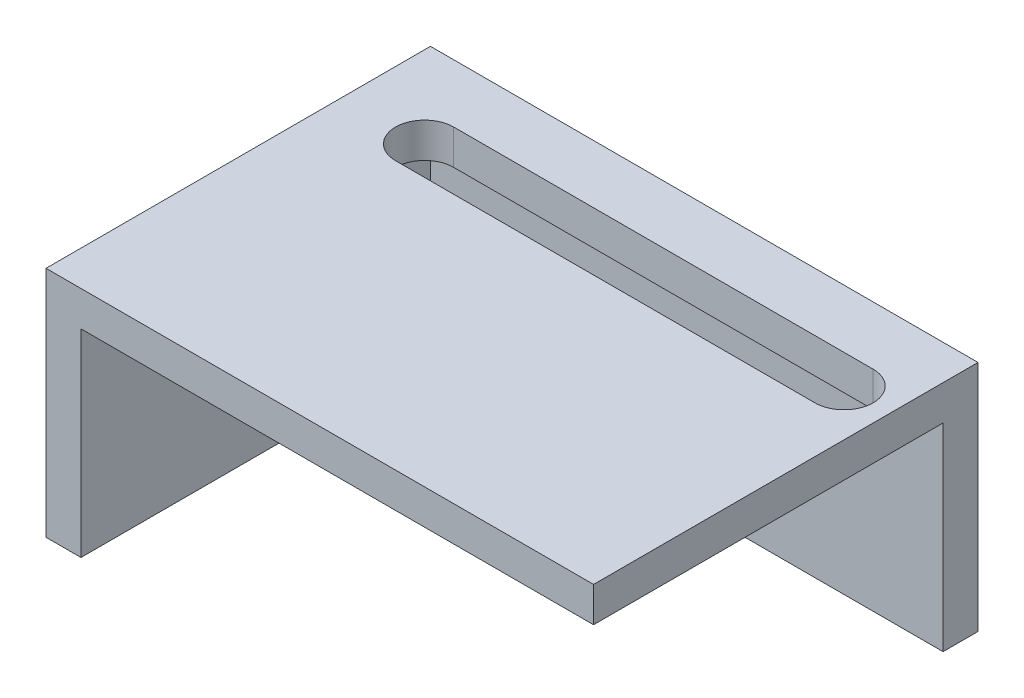
ISO-10303-21;
HEADER;
FILE_DESCRIPTION(('STEP AP214'),'2;1');
FILE_NAME('part.step','',(''),(''),'','','');
FILE_SCHEMA(('AUTOMOTIVE_DESIGN { 1 0 10303 214 1 1 1 1 }'));
ENDSEC;
DATA;
#1=APPLICATION_CONTEXT('core data for automotive mechanical design processes');
#2=APPLICATION_PROTOCOL_DEFINITION('international standard','automotive_design',2000,#1);
#3=PRODUCT_CONTEXT('',#1,'mechanical');
#4=PRODUCT('Part','Part','',(#3));
#5=PRODUCT_RELATED_PRODUCT_CATEGORY('part','',(#4));
#6=PRODUCT_DEFINITION_FORMATION('','',#4);
#7=PRODUCT_DEFINITION_CONTEXT('part definition',#1,'design');
#8=PRODUCT_DEFINITION('design','',#6,#7);
#9=PRODUCT_DEFINITION_SHAPE('','',#8);
#10=(LENGTH_UNIT() NAMED_UNIT(*) SI_UNIT(.MILLI.,.METRE.));
#11=(NAMED_UNIT(*) PLANE_ANGLE_UNIT() SI_UNIT($,.RADIAN.));
#12=(NAMED_UNIT(*) SI_UNIT($,.STERADIAN.) SOLID_ANGLE_UNIT());
#13=UNCERTAINTY_MEASURE_WITH_UNIT(LENGTH_MEASURE(1.E-05),#10,'distance_accuracy_value','');
#14=(GEOMETRIC_REPRESENTATION_CONTEXT(3) GLOBAL_UNCERTAINTY_ASSIGNED_CONTEXT((#13)) GLOBAL_UNIT_ASSIGNED_CONTEXT((#10,
#11,#12)) REPRESENTATION_CONTEXT('',''));
#15=CARTESIAN_POINT('',(0.,0.,0.));
#16=DIRECTION('',(0.,0.,1.));
#17=DIRECTION('',(1.,0.,0.));
#18=AXIS2_PLACEMENT_3D('',#15,#16,#17);
#19=CARTESIAN_POINT('',(22.,3.,15.));
#20=DIRECTION('',(0.,0.,-1.));
#21=DIRECTION('',(-1.,0.,0.));
#22=AXIS2_PLACEMENT_3D('',#19,#20,#21);
#23=PLANE('',#22);
#24=DIRECTION('',(1.,0.,0.));
#25=VECTOR('',#24,1.);
#26=CARTESIAN_POINT('',(22.,0.,15.));
#27=LINE('',#26,#25);
#28=CARTESIAN_POINT('',(-22.,0.,15.));
#29=VERTEX_POINT('',#28);
#30=CARTESIAN_POINT('',(22.,0.,15.));
#31=VERTEX_POINT('',#30);
#32=EDGE_CURVE('E235',#29,#31,#27,.T.);
#33=ORIENTED_EDGE('',*,*,#32,.T.);
#34=DIRECTION('',(0.,-1.,0.));
#35=VECTOR('',#34,1.);
#36=CARTESIAN_POINT('',(22.,3.,15.));
#37=LINE('',#36,#35);
#38=CARTESIAN_POINT('',(22.,3.,15.));
#39=VERTEX_POINT('',#38);
#40=EDGE_CURVE('E11',#39,#31,#37,.T.);
#41=ORIENTED_EDGE('',*,*,#40,.F.);
#42=DIRECTION('',(1.,0.,0.));
#43=VECTOR('',#42,1.);
#44=CARTESIAN_POINT('',(22.,3.,15.));
#45=LINE('',#44,#43);
#46=CARTESIAN_POINT('',(-25.,3.,15.));
#47=VERTEX_POINT('',#46);
#48=EDGE_CURVE('E226',#47,#39,#45,.T.);
#49=ORIENTED_EDGE('',*,*,#48,.F.);
#50=DIRECTION('',(0.,1.,0.));
#51=VECTOR('',#50,1.);
#52=CARTESIAN_POINT('',(-25.,3.,15.));
#53=LINE('',#52,#51);
#54=CARTESIAN_POINT('',(-25.,-17.,15.));
#55=VERTEX_POINT('',#54);
#56=EDGE_CURVE('E183',#55,#47,#53,.T.);
#57=ORIENTED_EDGE('',*,*,#56,.F.);
#58=DIRECTION('',(1.,0.,0.));
#59=VECTOR('',#58,1.);
#60=CARTESIAN_POINT('',(-25.,-17.,15.));
#61=LINE('',#60,#59);
#62=CARTESIAN_POINT('',(-22.,-17.,15.));
#63=VERTEX_POINT('',#62);
#64=EDGE_CURVE('E191',#55,#63,#61,.T.);
#65=ORIENTED_EDGE('',*,*,#64,.T.);
#66=DIRECTION('',(0.,1.,0.));
#67=VECTOR('',#66,1.);
#68=CARTESIAN_POINT('',(-22.,3.,15.));
#69=LINE('',#68,#67);
#70=EDGE_CURVE('E180',#63,#29,#69,.T.);
#71=ORIENTED_EDGE('',*,*,#70,.T.);
#72=EDGE_LOOP('',(#33,#41,#49,#57,#65,#71));
#73=FACE_BOUND('',#72,.T.);
#74=ADVANCED_FACE('F43',(#73),#23,.F.);
#75=CARTESIAN_POINT('',(22.,3.,-15.));
#76=DIRECTION('',(-1.,0.,0.));
#77=DIRECTION('',(0.,0.,1.));
#78=AXIS2_PLACEMENT_3D('',#75,#76,#77);
#79=PLANE('',#78);
#80=DIRECTION('',(0.,0.,-1.));
#81=VECTOR('',#80,1.);
#82=CARTESIAN_POINT('',(22.,0.,-15.));
#83=LINE('',#82,#81);
#84=CARTESIAN_POINT('',(22.,0.,-15.));
#85=VERTEX_POINT('',#84);
#86=EDGE_CURVE('E238',#31,#85,#83,.T.);
#87=ORIENTED_EDGE('',*,*,#86,.T.);
#88=DIRECTION('',(0.,-1.,0.));
#89=VECTOR('',#88,1.);
#90=CARTESIAN_POINT('',(22.,3.,-15.));
#91=LINE('',#90,#89);
#92=CARTESIAN_POINT('',(22.,-17.,-15.));
#93=VERTEX_POINT('',#92);
#94=EDGE_CURVE('E200',#85,#93,#91,.T.);
#95=ORIENTED_EDGE('',*,*,#94,.T.);
#96=DIRECTION('',(0.,0.,1.));
#97=VECTOR('',#96,1.);
#98=CARTESIAN_POINT('',(22.,-17.,-18.));
#99=LINE('',#98,#97);
#100=CARTESIAN_POINT('',(22.,-17.,-18.));
#101=VERTEX_POINT('',#100);
#102=EDGE_CURVE('E213',#101,#93,#99,.T.);
#103=ORIENTED_EDGE('',*,*,#102,.F.);
#104=DIRECTION('',(0.,-1.,0.));
#105=VECTOR('',#104,1.);
#106=CARTESIAN_POINT('',(22.,3.,-18.));
#107=LINE('',#106,#105);
#108=CARTESIAN_POINT('',(22.,3.,-18.));
#109=VERTEX_POINT('',#108);
#110=EDGE_CURVE('E201',#109,#101,#107,.T.);
#111=ORIENTED_EDGE('',*,*,#110,.F.);
#112=DIRECTION('',(0.,0.,-1.));
#113=VECTOR('',#112,1.);
#114=CARTESIAN_POINT('',(22.,3.,-15.));
#115=LINE('',#114,#113);
#116=EDGE_CURVE('E51',#39,#109,#115,.T.);
#117=ORIENTED_EDGE('',*,*,#116,.F.);
#118=ORIENTED_EDGE('',*,*,#40,.T.);
#119=EDGE_LOOP('',(#87,#95,#103,#111,#117,#118));
#120=FACE_BOUND('',#119,.T.);
#121=ADVANCED_FACE('F272',(#120),#79,.F.);
#122=CARTESIAN_POINT('',(0.,3.,0.));
#123=DIRECTION('',(0.,-1.,0.));
#124=DIRECTION('',(0.,0.,-1.));
#125=AXIS2_PLACEMENT_3D('',#122,#123,#124);
#126=PLANE('',#125);
#127=DIRECTION('',(-1.,0.,0.));
#128=VECTOR('',#127,1.);
#129=CARTESIAN_POINT('',(-18.,3.,-8.));
#130=LINE('',#129,#128);
#131=CARTESIAN_POINT('',(18.,3.,-8.));
#132=VERTEX_POINT('',#131);
#133=CARTESIAN_POINT('',(-18.,3.,-8.));
#134=VERTEX_POINT('',#133);
#135=EDGE_CURVE('E135',#132,#134,#130,.T.);
#136=ORIENTED_EDGE('',*,*,#135,.T.);
#137=CARTESIAN_POINT('',(-18.,3.,-10.5));
#138=DIRECTION('',(0.,-1.,0.));
#139=DIRECTION('',(0.,0.,-1.));
#140=AXIS2_PLACEMENT_3D('',#137,#138,#139);
#141=CIRCLE('',#140,2.5);
#142=CARTESIAN_POINT('',(-18.,3.,-13.));
#143=VERTEX_POINT('',#142);
#144=EDGE_CURVE('E128',#134,#143,#141,.T.);
#145=ORIENTED_EDGE('',*,*,#144,.T.);
#146=DIRECTION('',(1.,0.,0.));
#147=VECTOR('',#146,1.);
#148=CARTESIAN_POINT('',(-18.,3.,-13.));
#149=LINE('',#148,#147);
#150=CARTESIAN_POINT('',(18.,3.,-13.));
#151=VERTEX_POINT('',#150);
#152=EDGE_CURVE('E138',#143,#151,#149,.T.);
#153=ORIENTED_EDGE('',*,*,#152,.T.);
#154=CARTESIAN_POINT('',(18.,3.,-10.5));
#155=DIRECTION('',(0.,-1.,0.));
#156=DIRECTION('',(0.,0.,-1.));
#157=AXIS2_PLACEMENT_3D('',#154,#155,#156);
#158=CIRCLE('',#157,2.5);
#159=EDGE_CURVE('E58',#151,#132,#158,.T.);
#160=ORIENTED_EDGE('',*,*,#159,.T.);
#161=EDGE_LOOP('',(#136,#145,#153,#160));
#162=FACE_BOUND('',#161,.T.);
#163=DIRECTION('',(1.,0.,0.));
#164=VECTOR('',#163,1.);
#165=CARTESIAN_POINT('',(22.,3.,-18.));
#166=LINE('',#165,#164);
#167=CARTESIAN_POINT('',(-25.,3.,-18.));
#168=VERTEX_POINT('',#167);
#169=EDGE_CURVE('E209',#168,#109,#166,.T.);
#170=ORIENTED_EDGE('',*,*,#169,.F.);
#171=DIRECTION('',(0.,0.,-1.));
#172=VECTOR('',#171,1.);
#173=CARTESIAN_POINT('',(-25.,3.,-18.));
#174=LINE('',#173,#172);
#175=EDGE_CURVE('E187',#47,#168,#174,.T.);
#176=ORIENTED_EDGE('',*,*,#175,.F.);
#177=ORIENTED_EDGE('',*,*,#48,.T.);
#178=ORIENTED_EDGE('',*,*,#116,.T.);
#179=EDGE_LOOP('',(#170,#176,#177,#178));
#180=FACE_BOUND('',#179,.T.);
#181=ADVANCED_FACE('F143',(#162,#180),#126,.F.);
#182=CARTESIAN_POINT('',(0.,0.,0.));
#183=DIRECTION('',(0.,-1.,0.));
#184=DIRECTION('',(0.,0.,-1.));
#185=AXIS2_PLACEMENT_3D('',#182,#183,#184);
#186=PLANE('',#185);
#187=CARTESIAN_POINT('',(-18.,0.,-10.5));
#188=DIRECTION('',(0.,-1.,0.));
#189=DIRECTION('',(0.,0.,-1.));
#190=AXIS2_PLACEMENT_3D('',#187,#188,#189);
#191=CIRCLE('',#190,2.5);
#192=CARTESIAN_POINT('',(-18.,0.,-8.));
#193=VERTEX_POINT('',#192);
#194=CARTESIAN_POINT('',(-18.,0.,-13.));
#195=VERTEX_POINT('',#194);
#196=EDGE_CURVE('E66',#193,#195,#191,.T.);
#197=ORIENTED_EDGE('',*,*,#196,.F.);
#198=DIRECTION('',(-1.,0.,0.));
#199=VECTOR('',#198,1.);
#200=CARTESIAN_POINT('',(-18.,0.,-8.));
#201=LINE('',#200,#199);
#202=CARTESIAN_POINT('',(18.,0.,-8.));
#203=VERTEX_POINT('',#202);
#204=EDGE_CURVE('E147',#203,#193,#201,.T.);
#205=ORIENTED_EDGE('',*,*,#204,.F.);
#206=CARTESIAN_POINT('',(18.,0.,-10.5));
#207=DIRECTION('',(0.,-1.,0.));
#208=DIRECTION('',(0.,0.,-1.));
#209=AXIS2_PLACEMENT_3D('',#206,#207,#208);
#210=CIRCLE('',#209,2.5);
#211=CARTESIAN_POINT('',(18.,0.,-13.));
#212=VERTEX_POINT('',#211);
#213=EDGE_CURVE('E151',#212,#203,#210,.T.);
#214=ORIENTED_EDGE('',*,*,#213,.F.);
#215=DIRECTION('',(1.,0.,0.));
#216=VECTOR('',#215,1.);
#217=CARTESIAN_POINT('',(-18.,0.,-13.));
#218=LINE('',#217,#216);
#219=EDGE_CURVE('E160',#195,#212,#218,.T.);
#220=ORIENTED_EDGE('',*,*,#219,.F.);
#221=EDGE_LOOP('',(#197,#205,#214,#220));
#222=FACE_BOUND('',#221,.T.);
#223=DIRECTION('',(0.,0.,1.));
#224=VECTOR('',#223,1.);
#225=CARTESIAN_POINT('',(-22.,0.,-15.));
#226=LINE('',#225,#224);
#227=CARTESIAN_POINT('',(-22.,0.,-15.));
#228=VERTEX_POINT('',#227);
#229=EDGE_CURVE('E225',#228,#29,#226,.T.);
#230=ORIENTED_EDGE('',*,*,#229,.F.);
#231=DIRECTION('',(-1.,0.,0.));
#232=VECTOR('',#231,1.);
#233=CARTESIAN_POINT('',(22.,0.,-15.));
#234=LINE('',#233,#232);
#235=EDGE_CURVE('E229',#85,#228,#234,.T.);
#236=ORIENTED_EDGE('',*,*,#235,.F.);
#237=ORIENTED_EDGE('',*,*,#86,.F.);
#238=ORIENTED_EDGE('',*,*,#32,.F.);
#239=EDGE_LOOP('',(#230,#236,#237,#238));
#240=FACE_BOUND('',#239,.T.);
#241=ADVANCED_FACE('F251',(#222,#240),#186,.T.);
#242=CARTESIAN_POINT('',(0.,0.,-15.));
#243=DIRECTION('',(0.,0.,-1.));
#244=DIRECTION('',(-1.,0.,0.));
#245=AXIS2_PLACEMENT_3D('',#242,#243,#244);
#246=PLANE('',#245);
#247=ORIENTED_EDGE('',*,*,#94,.F.);
#248=ORIENTED_EDGE('',*,*,#235,.T.);
#249=DIRECTION('',(0.,1.,0.));
#250=VECTOR('',#249,1.);
#251=CARTESIAN_POINT('',(-22.,3.,-15.));
#252=LINE('',#251,#250);
#253=CARTESIAN_POINT('',(-22.,-17.,-15.));
#254=VERTEX_POINT('',#253);
#255=EDGE_CURVE('E206',#254,#228,#252,.T.);
#256=ORIENTED_EDGE('',*,*,#255,.F.);
#257=DIRECTION('',(-1.,0.,0.));
#258=VECTOR('',#257,1.);
#259=CARTESIAN_POINT('',(22.,-17.,-15.));
#260=LINE('',#259,#258);
#261=EDGE_CURVE('E216',#93,#254,#260,.T.);
#262=ORIENTED_EDGE('',*,*,#261,.F.);
#263=EDGE_LOOP('',(#247,#248,#256,#262));
#264=FACE_BOUND('',#263,.T.);
#265=ADVANCED_FACE('F246',(#264),#246,.F.);
#266=CARTESIAN_POINT('',(22.,-17.,-18.));
#267=DIRECTION('',(0.,1.,0.));
#268=DIRECTION('',(0.,0.,1.));
#269=AXIS2_PLACEMENT_3D('',#266,#267,#268);
#270=PLANE('',#269);
#271=ORIENTED_EDGE('',*,*,#261,.T.);
#272=DIRECTION('',(0.,0.,1.));
#273=VECTOR('',#272,1.);
#274=CARTESIAN_POINT('',(-22.,-17.,-18.));
#275=LINE('',#274,#273);
#276=EDGE_CURVE('E169',#254,#63,#275,.T.);
#277=ORIENTED_EDGE('',*,*,#276,.T.);
#278=ORIENTED_EDGE('',*,*,#64,.F.);
#279=DIRECTION('',(0.,0.,1.));
#280=VECTOR('',#279,1.);
#281=CARTESIAN_POINT('',(-25.,-17.,-18.));
#282=LINE('',#281,#280);
#283=CARTESIAN_POINT('',(-25.,-17.,-18.));
#284=VERTEX_POINT('',#283);
#285=EDGE_CURVE('E179',#284,#55,#282,.T.);
#286=ORIENTED_EDGE('',*,*,#285,.F.);
#287=DIRECTION('',(-1.,0.,0.));
#288=VECTOR('',#287,1.);
#289=CARTESIAN_POINT('',(22.,-17.,-18.));
#290=LINE('',#289,#288);
#291=EDGE_CURVE('E205',#101,#284,#290,.T.);
#292=ORIENTED_EDGE('',*,*,#291,.F.);
#293=ORIENTED_EDGE('',*,*,#102,.T.);
#294=EDGE_LOOP('',(#271,#277,#278,#286,#292,#293));
#295=FACE_BOUND('',#294,.T.);
#296=ADVANCED_FACE('F257',(#295),#270,.F.);
#297=CARTESIAN_POINT('',(0.,0.,-18.));
#298=DIRECTION('',(0.,0.,-1.));
#299=DIRECTION('',(-1.,0.,0.));
#300=AXIS2_PLACEMENT_3D('',#297,#298,#299);
#301=PLANE('',#300);
#302=ORIENTED_EDGE('',*,*,#110,.T.);
#303=ORIENTED_EDGE('',*,*,#291,.T.);
#304=DIRECTION('',(0.,-1.,0.));
#305=VECTOR('',#304,1.);
#306=CARTESIAN_POINT('',(-25.,3.,-18.));
#307=LINE('',#306,#305);
#308=EDGE_CURVE('E175',#168,#284,#307,.T.);
#309=ORIENTED_EDGE('',*,*,#308,.F.);
#310=ORIENTED_EDGE('',*,*,#169,.T.);
#311=EDGE_LOOP('',(#302,#303,#309,#310));
#312=FACE_BOUND('',#311,.T.);
#313=ADVANCED_FACE('F269',(#312),#301,.T.);
#314=CARTESIAN_POINT('',(-22.,0.,0.));
#315=DIRECTION('',(-1.,0.,0.));
#316=DIRECTION('',(0.,0.,1.));
#317=AXIS2_PLACEMENT_3D('',#314,#315,#316);
#318=PLANE('',#317);
#319=ORIENTED_EDGE('',*,*,#255,.T.);
#320=ORIENTED_EDGE('',*,*,#229,.T.);
#321=ORIENTED_EDGE('',*,*,#70,.F.);
#322=ORIENTED_EDGE('',*,*,#276,.F.);
#323=EDGE_LOOP('',(#319,#320,#321,#322));
#324=FACE_BOUND('',#323,.T.);
#325=ADVANCED_FACE('F254',(#324),#318,.F.);
#326=CARTESIAN_POINT('',(-25.,0.,0.));
#327=DIRECTION('',(-1.,0.,0.));
#328=DIRECTION('',(0.,0.,1.));
#329=AXIS2_PLACEMENT_3D('',#326,#327,#328);
#330=PLANE('',#329);
#331=ORIENTED_EDGE('',*,*,#308,.T.);
#332=ORIENTED_EDGE('',*,*,#285,.T.);
#333=ORIENTED_EDGE('',*,*,#56,.T.);
#334=ORIENTED_EDGE('',*,*,#175,.T.);
#335=EDGE_LOOP('',(#331,#332,#333,#334));
#336=FACE_BOUND('',#335,.T.);
#337=ADVANCED_FACE('F264',(#336),#330,.T.);
#338=CARTESIAN_POINT('',(-18.,3.,-10.5));
#339=DIRECTION('',(0.,-1.,0.));
#340=DIRECTION('',(0.,0.,-1.));
#341=AXIS2_PLACEMENT_3D('',#338,#339,#340);
#342=CYLINDRICAL_SURFACE('',#341,2.5);
#343=ORIENTED_EDGE('',*,*,#196,.T.);
#344=DIRECTION('',(0.,-1.,0.));
#345=VECTOR('',#344,1.);
#346=CARTESIAN_POINT('',(-18.,3.,-13.));
#347=LINE('',#346,#345);
#348=EDGE_CURVE('E124',#143,#195,#347,.T.);
#349=ORIENTED_EDGE('',*,*,#348,.F.);
#350=ORIENTED_EDGE('',*,*,#144,.F.);
#351=DIRECTION('',(0.,-1.,0.));
#352=VECTOR('',#351,1.);
#353=CARTESIAN_POINT('',(-18.,3.,-8.));
#354=LINE('',#353,#352);
#355=EDGE_CURVE('E166',#134,#193,#354,.T.);
#356=ORIENTED_EDGE('',*,*,#355,.T.);
#357=EDGE_LOOP('',(#343,#349,#350,#356));
#358=FACE_BOUND('',#357,.T.);
#359=ADVANCED_FACE('F126',(#358),#342,.F.);
#360=CARTESIAN_POINT('',(-18.,3.,-8.));
#361=DIRECTION('',(0.,0.,1.));
#362=DIRECTION('',(1.,0.,0.));
#363=AXIS2_PLACEMENT_3D('',#360,#361,#362);
#364=PLANE('',#363);
#365=ORIENTED_EDGE('',*,*,#204,.T.);
#366=ORIENTED_EDGE('',*,*,#355,.F.);
#367=ORIENTED_EDGE('',*,*,#135,.F.);
#368=DIRECTION('',(0.,-1.,0.));
#369=VECTOR('',#368,1.);
#370=CARTESIAN_POINT('',(18.,3.,-8.));
#371=LINE('',#370,#369);
#372=EDGE_CURVE('E170',#132,#203,#371,.T.);
#373=ORIENTED_EDGE('',*,*,#372,.T.);
#374=EDGE_LOOP('',(#365,#366,#367,#373));
#375=FACE_BOUND('',#374,.T.);
#376=ADVANCED_FACE('F295',(#375),#364,.F.);
#377=CARTESIAN_POINT('',(18.,3.,-10.5));
#378=DIRECTION('',(0.,-1.,0.));
#379=DIRECTION('',(0.,0.,-1.));
#380=AXIS2_PLACEMENT_3D('',#377,#378,#379);
#381=CYLINDRICAL_SURFACE('',#380,2.5);
#382=ORIENTED_EDGE('',*,*,#213,.T.);
#383=ORIENTED_EDGE('',*,*,#372,.F.);
#384=ORIENTED_EDGE('',*,*,#159,.F.);
#385=DIRECTION('',(0.,-1.,0.));
#386=VECTOR('',#385,1.);
#387=CARTESIAN_POINT('',(18.,3.,-13.));
#388=LINE('',#387,#386);
#389=EDGE_CURVE('E134',#151,#212,#388,.T.);
#390=ORIENTED_EDGE('',*,*,#389,.T.);
#391=EDGE_LOOP('',(#382,#383,#384,#390));
#392=FACE_BOUND('',#391,.T.);
#393=ADVANCED_FACE('F298',(#392),#381,.F.);
#394=CARTESIAN_POINT('',(-18.,3.,-13.));
#395=DIRECTION('',(0.,0.,-1.));
#396=DIRECTION('',(-1.,0.,0.));
#397=AXIS2_PLACEMENT_3D('',#394,#395,#396);
#398=PLANE('',#397);
#399=ORIENTED_EDGE('',*,*,#219,.T.);
#400=ORIENTED_EDGE('',*,*,#389,.F.);
#401=ORIENTED_EDGE('',*,*,#152,.F.);
#402=ORIENTED_EDGE('',*,*,#348,.T.);
#403=EDGE_LOOP('',(#399,#400,#401,#402));
#404=FACE_BOUND('',#403,.T.);
#405=ADVANCED_FACE('F139',(#404),#398,.F.);
#406=CLOSED_SHELL('',(#74,#121,#181,#241,#265,#296,#313,#325,#337,#359,#376,#393,#405));
#407=MANIFOLD_SOLID_BREP('B2',#406);
#408=ADVANCED_BREP_SHAPE_REPRESENTATION('',(#18,#407),#14);
#409=SHAPE_DEFINITION_REPRESENTATION(#9,#408);
ENDSEC;
END-ISO-10303-21;
